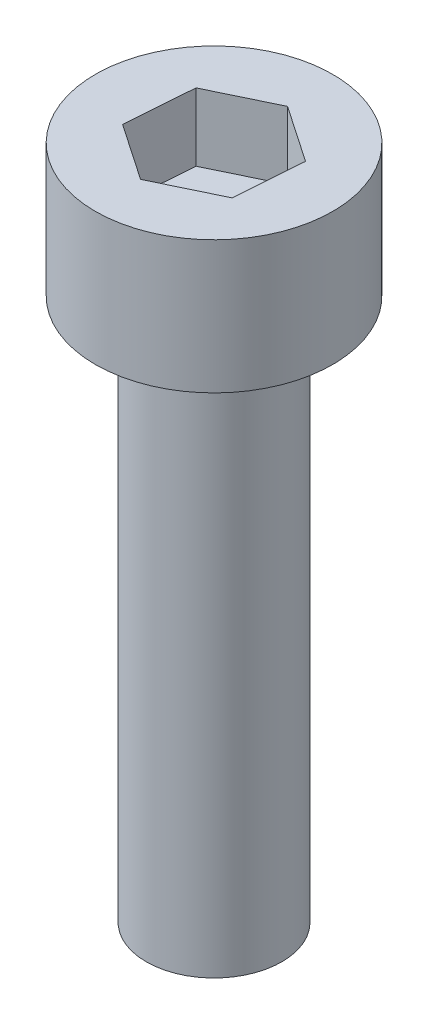
ISO-10303-21;
HEADER;
FILE_DESCRIPTION(('STEP AP214'),'2;1');
FILE_NAME('part.step','',(''),(''),'','','');
FILE_SCHEMA(('AUTOMOTIVE_DESIGN { 1 0 10303 214 1 1 1 1 }'));
ENDSEC;
DATA;
#1=APPLICATION_CONTEXT('core data for automotive mechanical design processes');
#2=APPLICATION_PROTOCOL_DEFINITION('international standard','automotive_design',2000,#1);
#3=PRODUCT_CONTEXT('',#1,'mechanical');
#4=PRODUCT('Part','Part','',(#3));
#5=PRODUCT_RELATED_PRODUCT_CATEGORY('part','',(#4));
#6=PRODUCT_DEFINITION_FORMATION('','',#4);
#7=PRODUCT_DEFINITION_CONTEXT('part definition',#1,'design');
#8=PRODUCT_DEFINITION('design','',#6,#7);
#9=PRODUCT_DEFINITION_SHAPE('','',#8);
#10=(LENGTH_UNIT() NAMED_UNIT(*) SI_UNIT(.MILLI.,.METRE.));
#11=(NAMED_UNIT(*) PLANE_ANGLE_UNIT() SI_UNIT($,.RADIAN.));
#12=(NAMED_UNIT(*) SI_UNIT($,.STERADIAN.) SOLID_ANGLE_UNIT());
#13=UNCERTAINTY_MEASURE_WITH_UNIT(LENGTH_MEASURE(1.E-05),#10,'distance_accuracy_value','');
#14=(GEOMETRIC_REPRESENTATION_CONTEXT(3) GLOBAL_UNCERTAINTY_ASSIGNED_CONTEXT((#13)) GLOBAL_UNIT_ASSIGNED_CONTEXT((#10,
#11,#12)) REPRESENTATION_CONTEXT('',''));
#15=CARTESIAN_POINT('',(0.,0.,0.));
#16=DIRECTION('',(0.,0.,1.));
#17=DIRECTION('',(1.,0.,0.));
#18=AXIS2_PLACEMENT_3D('',#15,#16,#17);
#19=CARTESIAN_POINT('',(0.,16.,0.));
#20=DIRECTION('',(0.,-1.,0.));
#21=DIRECTION('',(0.,0.,-1.));
#22=AXIS2_PLACEMENT_3D('',#19,#20,#21);
#23=CYLINDRICAL_SURFACE('',#22,2.);
#24=CARTESIAN_POINT('',(0.,16.,0.));
#25=DIRECTION('',(0.,1.,0.));
#26=DIRECTION('',(0.,0.,1.));
#27=AXIS2_PLACEMENT_3D('',#24,#25,#26);
#28=CIRCLE('',#27,2.);
#29=CARTESIAN_POINT('',(0.,16.,2.));
#30=VERTEX_POINT('',#29);
#31=EDGE_CURVE('E11',#30,#30,#28,.T.);
#32=ORIENTED_EDGE('',*,*,#31,.F.);
#33=EDGE_LOOP('',(#32));
#34=FACE_BOUND('',#33,.T.);
#35=CARTESIAN_POINT('',(0.,0.,0.));
#36=DIRECTION('',(0.,1.,0.));
#37=DIRECTION('',(0.,0.,1.));
#38=AXIS2_PLACEMENT_3D('',#35,#36,#37);
#39=CIRCLE('',#38,2.);
#40=CARTESIAN_POINT('',(0.,0.,2.));
#41=VERTEX_POINT('',#40);
#42=EDGE_CURVE('E42',#41,#41,#39,.T.);
#43=ORIENTED_EDGE('',*,*,#42,.T.);
#44=EDGE_LOOP('',(#43));
#45=FACE_BOUND('',#44,.T.);
#46=ADVANCED_FACE('F39',(#34,#45),#23,.T.);
#47=CARTESIAN_POINT('',(0.,0.,0.));
#48=DIRECTION('',(0.,1.,0.));
#49=DIRECTION('',(0.,0.,1.));
#50=AXIS2_PLACEMENT_3D('',#47,#48,#49);
#51=PLANE('',#50);
#52=ORIENTED_EDGE('',*,*,#42,.F.);
#53=EDGE_LOOP('',(#52));
#54=FACE_BOUND('',#53,.T.);
#55=ADVANCED_FACE('F189',(#54),#51,.F.);
#56=CARTESIAN_POINT('',(0.,19.91,0.));
#57=DIRECTION('',(0.,-1.,0.));
#58=DIRECTION('',(0.,0.,-1.));
#59=AXIS2_PLACEMENT_3D('',#56,#57,#58);
#60=CYLINDRICAL_SURFACE('',#59,3.5);
#61=CARTESIAN_POINT('',(0.,19.91,0.));
#62=DIRECTION('',(0.,1.,0.));
#63=DIRECTION('',(0.,0.,1.));
#64=AXIS2_PLACEMENT_3D('',#61,#62,#63);
#65=CIRCLE('',#64,3.5);
#66=CARTESIAN_POINT('',(0.,19.91,3.5));
#67=VERTEX_POINT('',#66);
#68=EDGE_CURVE('E163',#67,#67,#65,.T.);
#69=ORIENTED_EDGE('',*,*,#68,.F.);
#70=EDGE_LOOP('',(#69));
#71=FACE_BOUND('',#70,.T.);
#72=CARTESIAN_POINT('',(0.,16.,0.));
#73=DIRECTION('',(0.,1.,0.));
#74=DIRECTION('',(0.,0.,1.));
#75=AXIS2_PLACEMENT_3D('',#72,#73,#74);
#76=CIRCLE('',#75,3.5);
#77=CARTESIAN_POINT('',(0.,16.,3.5));
#78=VERTEX_POINT('',#77);
#79=EDGE_CURVE('E153',#78,#78,#76,.T.);
#80=ORIENTED_EDGE('',*,*,#79,.T.);
#81=EDGE_LOOP('',(#80));
#82=FACE_BOUND('',#81,.T.);
#83=ADVANCED_FACE('F171',(#71,#82),#60,.T.);
#84=CARTESIAN_POINT('',(0.,19.91,0.));
#85=DIRECTION('',(0.,1.,0.));
#86=DIRECTION('',(0.,0.,1.));
#87=AXIS2_PLACEMENT_3D('',#84,#85,#86);
#88=PLANE('',#87);
#89=DIRECTION('',(0.901055467383614,0.,-0.433703867515725));
#90=VECTOR('',#89,1.);
#91=CARTESIAN_POINT('',(-0.15141131098273,19.91,2.0150453960742));
#92=LINE('',#91,#90);
#93=CARTESIAN_POINT('',(-0.15141131098273,19.91,2.0150453960742));
#94=VERTEX_POINT('',#93);
#95=CARTESIAN_POINT('',(1.66937484728777,19.91,1.13864873976845));
#96=VERTEX_POINT('',#95);
#97=EDGE_CURVE('E54',#94,#96,#92,.T.);
#98=ORIENTED_EDGE('',*,*,#97,.F.);
#99=DIRECTION('',(0.826126300679985,0.,0.563484991215208));
#100=VECTOR('',#99,1.);
#101=CARTESIAN_POINT('',(-1.8207861582705,19.91,0.876396656305749));
#102=LINE('',#101,#100);
#103=CARTESIAN_POINT('',(-1.8207861582705,19.91,0.876396656305749));
#104=VERTEX_POINT('',#103);
#105=EDGE_CURVE('E147',#104,#94,#102,.T.);
#106=ORIENTED_EDGE('',*,*,#105,.F.);
#107=DIRECTION('',(-0.0749291667036284,0.,0.997188858730933));
#108=VECTOR('',#107,1.);
#109=CARTESIAN_POINT('',(-1.66937484728777,19.91,-1.13864873976845));
#110=LINE('',#109,#108);
#111=CARTESIAN_POINT('',(-1.66937484728777,19.91,-1.13864873976845));
#112=VERTEX_POINT('',#111);
#113=EDGE_CURVE('E144',#112,#104,#110,.T.);
#114=ORIENTED_EDGE('',*,*,#113,.F.);
#115=DIRECTION('',(-0.901055467383614,0.,0.433703867515725));
#116=VECTOR('',#115,1.);
#117=CARTESIAN_POINT('',(0.15141131098273,19.91,-2.0150453960742));
#118=LINE('',#117,#116);
#119=CARTESIAN_POINT('',(0.15141131098273,19.91,-2.0150453960742));
#120=VERTEX_POINT('',#119);
#121=EDGE_CURVE('E102',#120,#112,#118,.T.);
#122=ORIENTED_EDGE('',*,*,#121,.F.);
#123=DIRECTION('',(-0.826126300679985,0.,-0.563484991215208));
#124=VECTOR('',#123,1.);
#125=CARTESIAN_POINT('',(1.8207861582705,19.91,-0.87639665630575));
#126=LINE('',#125,#124);
#127=CARTESIAN_POINT('',(1.8207861582705,19.91,-0.87639665630575));
#128=VERTEX_POINT('',#127);
#129=EDGE_CURVE('E138',#128,#120,#126,.T.);
#130=ORIENTED_EDGE('',*,*,#129,.F.);
#131=DIRECTION('',(0.0749291667036284,0.,-0.997188858730933));
#132=VECTOR('',#131,1.);
#133=CARTESIAN_POINT('',(1.66937484728777,19.91,1.13864873976845));
#134=LINE('',#133,#132);
#135=EDGE_CURVE('E134',#96,#128,#134,.T.);
#136=ORIENTED_EDGE('',*,*,#135,.F.);
#137=EDGE_LOOP('',(#98,#106,#114,#122,#130,#136));
#138=FACE_BOUND('',#137,.T.);
#139=ORIENTED_EDGE('',*,*,#68,.T.);
#140=EDGE_LOOP('',(#139));
#141=FACE_BOUND('',#140,.T.);
#142=ADVANCED_FACE('F176',(#138,#141),#88,.T.);
#143=CARTESIAN_POINT('',(0.,16.,0.));
#144=DIRECTION('',(0.,1.,0.));
#145=DIRECTION('',(0.,0.,1.));
#146=AXIS2_PLACEMENT_3D('',#143,#144,#145);
#147=PLANE('',#146);
#148=ORIENTED_EDGE('',*,*,#31,.T.);
#149=EDGE_LOOP('',(#148));
#150=FACE_BOUND('',#149,.T.);
#151=ORIENTED_EDGE('',*,*,#79,.F.);
#152=EDGE_LOOP('',(#151));
#153=FACE_BOUND('',#152,.T.);
#154=ADVANCED_FACE('F173',(#150,#153),#147,.F.);
#155=CARTESIAN_POINT('',(-0.15141131098273,17.91,2.0150453960742));
#156=DIRECTION('',(0.433703867515725,0.,0.901055467383614));
#157=DIRECTION('',(0.901055467383614,0.,-0.433703867515725));
#158=AXIS2_PLACEMENT_3D('',#155,#156,#157);
#159=PLANE('',#158);
#160=ORIENTED_EDGE('',*,*,#97,.T.);
#161=DIRECTION('',(0.,1.,0.));
#162=VECTOR('',#161,1.);
#163=CARTESIAN_POINT('',(1.66937484728777,17.91,1.13864873976845));
#164=LINE('',#163,#162);
#165=CARTESIAN_POINT('',(1.66937484728777,17.91,1.13864873976845));
#166=VERTEX_POINT('',#165);
#167=EDGE_CURVE('E84',#166,#96,#164,.T.);
#168=ORIENTED_EDGE('',*,*,#167,.F.);
#169=DIRECTION('',(0.901055467383614,0.,-0.433703867515725));
#170=VECTOR('',#169,1.);
#171=CARTESIAN_POINT('',(-0.15141131098273,17.91,2.0150453960742));
#172=LINE('',#171,#170);
#173=CARTESIAN_POINT('',(-0.15141131098273,17.91,2.0150453960742));
#174=VERTEX_POINT('',#173);
#175=EDGE_CURVE('E150',#174,#166,#172,.T.);
#176=ORIENTED_EDGE('',*,*,#175,.F.);
#177=DIRECTION('',(0.,1.,0.));
#178=VECTOR('',#177,1.);
#179=CARTESIAN_POINT('',(-0.15141131098273,17.91,2.0150453960742));
#180=LINE('',#179,#178);
#181=EDGE_CURVE('E62',#174,#94,#180,.T.);
#182=ORIENTED_EDGE('',*,*,#181,.T.);
#183=EDGE_LOOP('',(#160,#168,#176,#182));
#184=FACE_BOUND('',#183,.T.);
#185=ADVANCED_FACE('F175',(#184),#159,.F.);
#186=CARTESIAN_POINT('',(-1.8207861582705,17.91,0.876396656305749));
#187=DIRECTION('',(-0.563484991215208,0.,0.826126300679985));
#188=DIRECTION('',(0.826126300679985,0.,0.563484991215208));
#189=AXIS2_PLACEMENT_3D('',#186,#187,#188);
#190=PLANE('',#189);
#191=ORIENTED_EDGE('',*,*,#105,.T.);
#192=ORIENTED_EDGE('',*,*,#181,.F.);
#193=DIRECTION('',(0.826126300679985,0.,0.563484991215208));
#194=VECTOR('',#193,1.);
#195=CARTESIAN_POINT('',(-1.8207861582705,17.91,0.876396656305749));
#196=LINE('',#195,#194);
#197=CARTESIAN_POINT('',(-1.8207861582705,17.91,0.876396656305749));
#198=VERTEX_POINT('',#197);
#199=EDGE_CURVE('E116',#198,#174,#196,.T.);
#200=ORIENTED_EDGE('',*,*,#199,.F.);
#201=DIRECTION('',(0.,1.,0.));
#202=VECTOR('',#201,1.);
#203=CARTESIAN_POINT('',(-1.8207861582705,17.91,0.876396656305749));
#204=LINE('',#203,#202);
#205=EDGE_CURVE('E107',#198,#104,#204,.T.);
#206=ORIENTED_EDGE('',*,*,#205,.T.);
#207=EDGE_LOOP('',(#191,#192,#200,#206));
#208=FACE_BOUND('',#207,.T.);
#209=ADVANCED_FACE('F183',(#208),#190,.F.);
#210=CARTESIAN_POINT('',(-1.66937484728777,17.91,-1.13864873976845));
#211=DIRECTION('',(-0.997188858730932,0.,-0.0749291667036284));
#212=DIRECTION('',(-0.0749291667036284,0.,0.997188858730933));
#213=AXIS2_PLACEMENT_3D('',#210,#211,#212);
#214=PLANE('',#213);
#215=ORIENTED_EDGE('',*,*,#113,.T.);
#216=ORIENTED_EDGE('',*,*,#205,.F.);
#217=DIRECTION('',(-0.0749291667036284,0.,0.997188858730933));
#218=VECTOR('',#217,1.);
#219=CARTESIAN_POINT('',(-1.66937484728777,17.91,-1.13864873976845));
#220=LINE('',#219,#218);
#221=CARTESIAN_POINT('',(-1.66937484728777,17.91,-1.13864873976845));
#222=VERTEX_POINT('',#221);
#223=EDGE_CURVE('E111',#222,#198,#220,.T.);
#224=ORIENTED_EDGE('',*,*,#223,.F.);
#225=DIRECTION('',(0.,1.,0.));
#226=VECTOR('',#225,1.);
#227=CARTESIAN_POINT('',(-1.66937484728777,17.91,-1.13864873976845));
#228=LINE('',#227,#226);
#229=EDGE_CURVE('E95',#222,#112,#228,.T.);
#230=ORIENTED_EDGE('',*,*,#229,.T.);
#231=EDGE_LOOP('',(#215,#216,#224,#230));
#232=FACE_BOUND('',#231,.T.);
#233=ADVANCED_FACE('F112',(#232),#214,.F.);
#234=CARTESIAN_POINT('',(0.15141131098273,17.91,-2.0150453960742));
#235=DIRECTION('',(-0.433703867515725,0.,-0.901055467383614));
#236=DIRECTION('',(-0.901055467383614,0.,0.433703867515725));
#237=AXIS2_PLACEMENT_3D('',#234,#235,#236);
#238=PLANE('',#237);
#239=ORIENTED_EDGE('',*,*,#121,.T.);
#240=ORIENTED_EDGE('',*,*,#229,.F.);
#241=DIRECTION('',(-0.901055467383614,0.,0.433703867515725));
#242=VECTOR('',#241,1.);
#243=CARTESIAN_POINT('',(0.15141131098273,17.91,-2.0150453960742));
#244=LINE('',#243,#242);
#245=CARTESIAN_POINT('',(0.15141131098273,17.91,-2.0150453960742));
#246=VERTEX_POINT('',#245);
#247=EDGE_CURVE('E99',#246,#222,#244,.T.);
#248=ORIENTED_EDGE('',*,*,#247,.F.);
#249=DIRECTION('',(0.,1.,0.));
#250=VECTOR('',#249,1.);
#251=CARTESIAN_POINT('',(0.15141131098273,17.91,-2.0150453960742));
#252=LINE('',#251,#250);
#253=EDGE_CURVE('E108',#246,#120,#252,.T.);
#254=ORIENTED_EDGE('',*,*,#253,.T.);
#255=EDGE_LOOP('',(#239,#240,#248,#254));
#256=FACE_BOUND('',#255,.T.);
#257=ADVANCED_FACE('F97',(#256),#238,.F.);
#258=CARTESIAN_POINT('',(1.8207861582705,17.91,-0.87639665630575));
#259=DIRECTION('',(0.563484991215208,0.,-0.826126300679985));
#260=DIRECTION('',(-0.826126300679985,0.,-0.563484991215208));
#261=AXIS2_PLACEMENT_3D('',#258,#259,#260);
#262=PLANE('',#261);
#263=ORIENTED_EDGE('',*,*,#129,.T.);
#264=ORIENTED_EDGE('',*,*,#253,.F.);
#265=DIRECTION('',(-0.826126300679985,0.,-0.563484991215208));
#266=VECTOR('',#265,1.);
#267=CARTESIAN_POINT('',(1.8207861582705,17.91,-0.87639665630575));
#268=LINE('',#267,#266);
#269=CARTESIAN_POINT('',(1.8207861582705,17.91,-0.87639665630575));
#270=VERTEX_POINT('',#269);
#271=EDGE_CURVE('E122',#270,#246,#268,.T.);
#272=ORIENTED_EDGE('',*,*,#271,.F.);
#273=DIRECTION('',(0.,1.,0.));
#274=VECTOR('',#273,1.);
#275=CARTESIAN_POINT('',(1.8207861582705,17.91,-0.87639665630575));
#276=LINE('',#275,#274);
#277=EDGE_CURVE('E158',#270,#128,#276,.T.);
#278=ORIENTED_EDGE('',*,*,#277,.T.);
#279=EDGE_LOOP('',(#263,#264,#272,#278));
#280=FACE_BOUND('',#279,.T.);
#281=ADVANCED_FACE('F245',(#280),#262,.F.);
#282=CARTESIAN_POINT('',(1.66937484728777,17.91,1.13864873976845));
#283=DIRECTION('',(0.997188858730932,0.,0.0749291667036284));
#284=DIRECTION('',(0.0749291667036284,0.,-0.997188858730933));
#285=AXIS2_PLACEMENT_3D('',#282,#283,#284);
#286=PLANE('',#285);
#287=ORIENTED_EDGE('',*,*,#135,.T.);
#288=ORIENTED_EDGE('',*,*,#277,.F.);
#289=DIRECTION('',(0.0749291667036284,0.,-0.997188858730933));
#290=VECTOR('',#289,1.);
#291=CARTESIAN_POINT('',(1.66937484728777,17.91,1.13864873976845));
#292=LINE('',#291,#290);
#293=EDGE_CURVE('E126',#166,#270,#292,.T.);
#294=ORIENTED_EDGE('',*,*,#293,.F.);
#295=ORIENTED_EDGE('',*,*,#167,.T.);
#296=EDGE_LOOP('',(#287,#288,#294,#295));
#297=FACE_BOUND('',#296,.T.);
#298=ADVANCED_FACE('F254',(#297),#286,.F.);
#299=CARTESIAN_POINT('',(0.,17.91,0.));
#300=DIRECTION('',(0.,1.,0.));
#301=DIRECTION('',(0.,0.,1.));
#302=AXIS2_PLACEMENT_3D('',#299,#300,#301);
#303=PLANE('',#302);
#304=ORIENTED_EDGE('',*,*,#175,.T.);
#305=ORIENTED_EDGE('',*,*,#293,.T.);
#306=ORIENTED_EDGE('',*,*,#271,.T.);
#307=ORIENTED_EDGE('',*,*,#247,.T.);
#308=ORIENTED_EDGE('',*,*,#223,.T.);
#309=ORIENTED_EDGE('',*,*,#199,.T.);
#310=EDGE_LOOP('',(#304,#305,#306,#307,#308,#309));
#311=FACE_BOUND('',#310,.T.);
#312=ADVANCED_FACE('F119',(#311),#303,.T.);
#313=CLOSED_SHELL('',(#46,#55,#83,#142,#154,#185,#209,#233,#257,#281,#298,#312));
#314=MANIFOLD_SOLID_BREP('B2',#313);
#315=ADVANCED_BREP_SHAPE_REPRESENTATION('',(#18,#314),#14);
#316=SHAPE_DEFINITION_REPRESENTATION(#9,#315);
ENDSEC;
END-ISO-10303-21;
